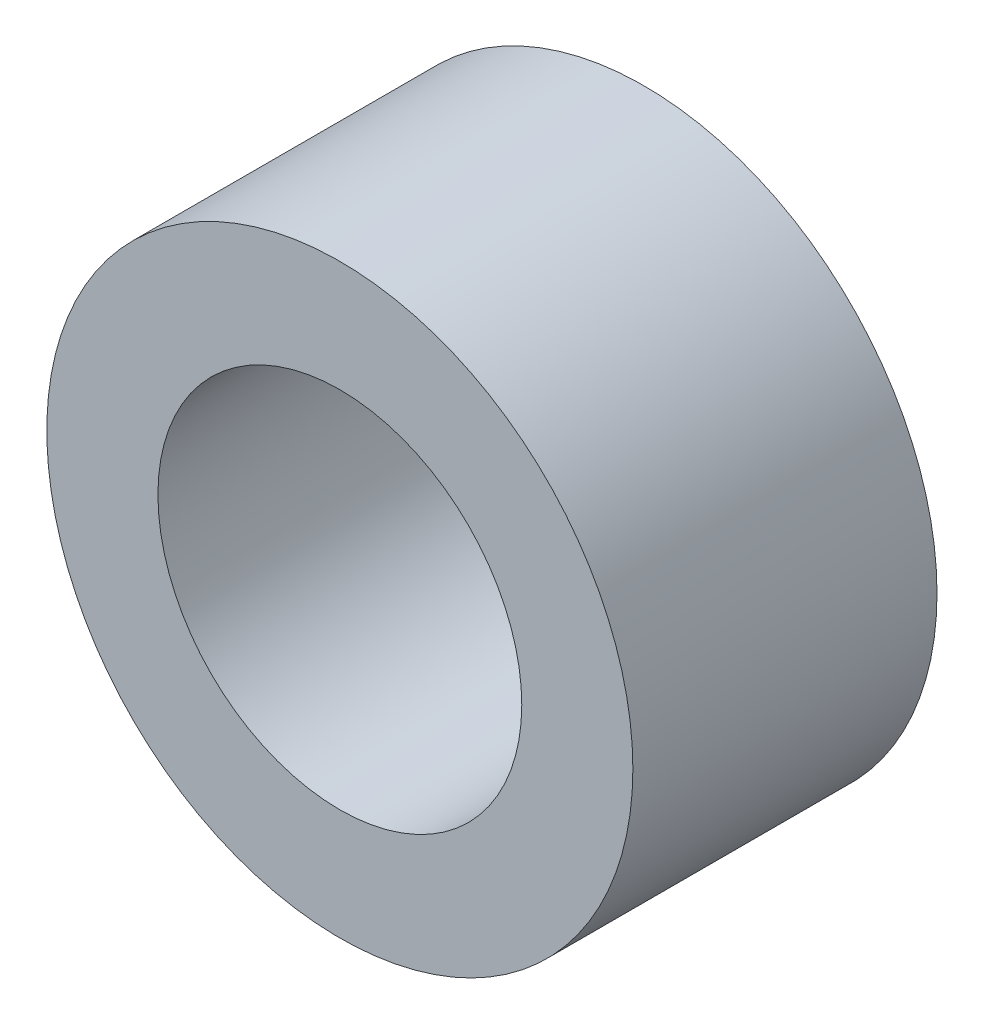
ISO-10303-21;
HEADER;
FILE_DESCRIPTION(('STEP AP214'),'2;1');
FILE_NAME('part.step','',(''),(''),'','','');
FILE_SCHEMA(('AUTOMOTIVE_DESIGN { 1 0 10303 214 1 1 1 1 }'));
ENDSEC;
DATA;
#1=APPLICATION_CONTEXT('core data for automotive mechanical design processes');
#2=APPLICATION_PROTOCOL_DEFINITION('international standard','automotive_design',2000,#1);
#3=PRODUCT_CONTEXT('',#1,'mechanical');
#4=PRODUCT('Part','Part','',(#3));
#5=PRODUCT_RELATED_PRODUCT_CATEGORY('part','',(#4));
#6=PRODUCT_DEFINITION_FORMATION('','',#4);
#7=PRODUCT_DEFINITION_CONTEXT('part definition',#1,'design');
#8=PRODUCT_DEFINITION('design','',#6,#7);
#9=PRODUCT_DEFINITION_SHAPE('','',#8);
#10=(LENGTH_UNIT() NAMED_UNIT(*) SI_UNIT(.MILLI.,.METRE.));
#11=(NAMED_UNIT(*) PLANE_ANGLE_UNIT() SI_UNIT($,.RADIAN.));
#12=(NAMED_UNIT(*) SI_UNIT($,.STERADIAN.) SOLID_ANGLE_UNIT());
#13=UNCERTAINTY_MEASURE_WITH_UNIT(LENGTH_MEASURE(1.E-05),#10,'distance_accuracy_value','');
#14=(GEOMETRIC_REPRESENTATION_CONTEXT(3) GLOBAL_UNCERTAINTY_ASSIGNED_CONTEXT((#13)) GLOBAL_UNIT_ASSIGNED_CONTEXT((#10,
#11,#12)) REPRESENTATION_CONTEXT('',''));
#15=CARTESIAN_POINT('',(0.,0.,0.));
#16=DIRECTION('',(0.,0.,1.));
#17=DIRECTION('',(1.,0.,0.));
#18=AXIS2_PLACEMENT_3D('',#15,#16,#17);
#19=CARTESIAN_POINT('',(3.32740000000001,320.521396786328,0.));
#20=DIRECTION('',(0.,0.,1.));
#21=DIRECTION('',(1.,0.,0.));
#22=AXIS2_PLACEMENT_3D('',#19,#20,#21);
#23=PLANE('',#22);
#24=CARTESIAN_POINT('',(0.,320.521396786328,0.));
#25=DIRECTION('',(0.,0.,1.));
#26=DIRECTION('',(1.,0.,0.));
#27=AXIS2_PLACEMENT_3D('',#24,#25,#26);
#28=CIRCLE('',#27,5.35940000000001);
#29=CARTESIAN_POINT('',(5.35940000000001,320.521396786328,0.));
#30=VERTEX_POINT('',#29);
#31=EDGE_CURVE('E10',#30,#30,#28,.T.);
#32=ORIENTED_EDGE('',*,*,#31,.T.);
#33=EDGE_LOOP('',(#32));
#34=FACE_BOUND('',#33,.T.);
#35=CARTESIAN_POINT('',(0.,320.521396786328,0.));
#36=DIRECTION('',(0.,0.,1.));
#37=DIRECTION('',(1.,0.,0.));
#38=AXIS2_PLACEMENT_3D('',#35,#36,#37);
#39=CIRCLE('',#38,3.32740000000001);
#40=CARTESIAN_POINT('',(3.32740000000001,320.521396786328,0.));
#41=VERTEX_POINT('',#40);
#42=EDGE_CURVE('E60',#41,#41,#39,.T.);
#43=ORIENTED_EDGE('',*,*,#42,.F.);
#44=EDGE_LOOP('',(#43));
#45=FACE_BOUND('',#44,.T.);
#46=ADVANCED_FACE('F43',(#34,#45),#23,.T.);
#47=CARTESIAN_POINT('',(0.,320.521396786328,-5.5626));
#48=DIRECTION('',(0.,0.,1.));
#49=DIRECTION('',(1.,0.,0.));
#50=AXIS2_PLACEMENT_3D('',#47,#48,#49);
#51=CYLINDRICAL_SURFACE('',#50,5.35940000000001);
#52=CARTESIAN_POINT('',(0.,320.521396786328,-5.5626));
#53=DIRECTION('',(0.,0.,1.));
#54=DIRECTION('',(1.,0.,0.));
#55=AXIS2_PLACEMENT_3D('',#52,#53,#54);
#56=CIRCLE('',#55,5.35940000000001);
#57=CARTESIAN_POINT('',(5.35940000000001,320.521396786328,-5.5626));
#58=VERTEX_POINT('',#57);
#59=EDGE_CURVE('E50',#58,#58,#56,.T.);
#60=ORIENTED_EDGE('',*,*,#59,.T.);
#61=EDGE_LOOP('',(#60));
#62=FACE_BOUND('',#61,.T.);
#63=ORIENTED_EDGE('',*,*,#31,.F.);
#64=EDGE_LOOP('',(#63));
#65=FACE_BOUND('',#64,.T.);
#66=ADVANCED_FACE('F71',(#62,#65),#51,.T.);
#67=CARTESIAN_POINT('',(5.35940000000001,320.521396786328,-5.5626));
#68=DIRECTION('',(0.,0.,-1.));
#69=DIRECTION('',(-1.,0.,0.));
#70=AXIS2_PLACEMENT_3D('',#67,#68,#69);
#71=PLANE('',#70);
#72=CARTESIAN_POINT('',(0.,320.521396786328,-5.5626));
#73=DIRECTION('',(0.,0.,1.));
#74=DIRECTION('',(1.,0.,0.));
#75=AXIS2_PLACEMENT_3D('',#72,#73,#74);
#76=CIRCLE('',#75,3.32740000000001);
#77=CARTESIAN_POINT('',(3.32740000000001,320.521396786328,-5.5626));
#78=VERTEX_POINT('',#77);
#79=EDGE_CURVE('E55',#78,#78,#76,.T.);
#80=ORIENTED_EDGE('',*,*,#79,.T.);
#81=EDGE_LOOP('',(#80));
#82=FACE_BOUND('',#81,.T.);
#83=ORIENTED_EDGE('',*,*,#59,.F.);
#84=EDGE_LOOP('',(#83));
#85=FACE_BOUND('',#84,.T.);
#86=ADVANCED_FACE('F75',(#82,#85),#71,.T.);
#87=CARTESIAN_POINT('',(0.,320.521396786328,-5.5626));
#88=DIRECTION('',(0.,0.,1.));
#89=DIRECTION('',(1.,0.,0.));
#90=AXIS2_PLACEMENT_3D('',#87,#88,#89);
#91=CYLINDRICAL_SURFACE('',#90,3.32740000000001);
#92=ORIENTED_EDGE('',*,*,#42,.T.);
#93=EDGE_LOOP('',(#92));
#94=FACE_BOUND('',#93,.T.);
#95=ORIENTED_EDGE('',*,*,#79,.F.);
#96=EDGE_LOOP('',(#95));
#97=FACE_BOUND('',#96,.T.);
#98=ADVANCED_FACE('F67',(#94,#97),#91,.F.);
#99=CLOSED_SHELL('',(#46,#66,#86,#98));
#100=MANIFOLD_SOLID_BREP('B2',#99);
#101=ADVANCED_BREP_SHAPE_REPRESENTATION('',(#18,#100),#14);
#102=SHAPE_DEFINITION_REPRESENTATION(#9,#101);
ENDSEC;
END-ISO-10303-21;
